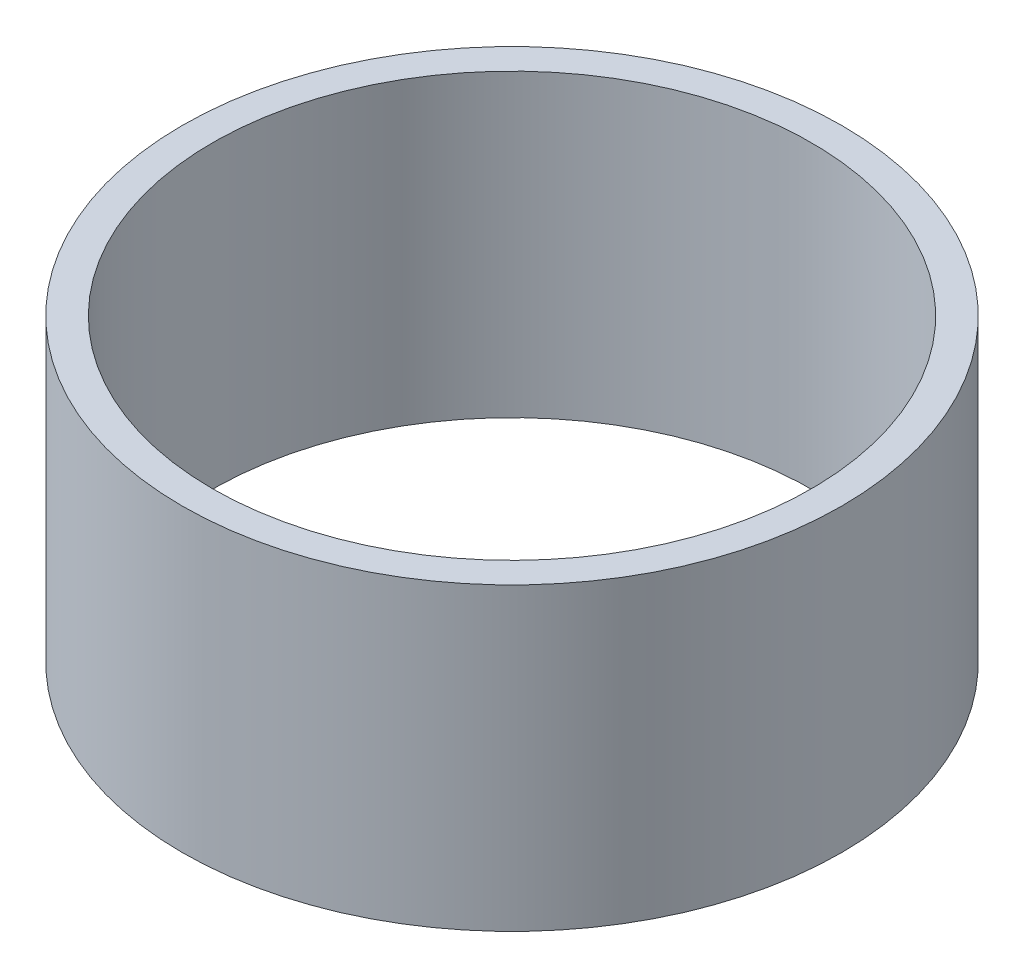
ISO-10303-21;
HEADER;
FILE_DESCRIPTION(('STEP AP214'),'2;1');
FILE_NAME('part.step','',(''),(''),'','','');
FILE_SCHEMA(('AUTOMOTIVE_DESIGN { 1 0 10303 214 1 1 1 1 }'));
ENDSEC;
DATA;
#1=APPLICATION_CONTEXT('core data for automotive mechanical design processes');
#2=APPLICATION_PROTOCOL_DEFINITION('international standard','automotive_design',2000,#1);
#3=PRODUCT_CONTEXT('',#1,'mechanical');
#4=PRODUCT('Part','Part','',(#3));
#5=PRODUCT_RELATED_PRODUCT_CATEGORY('part','',(#4));
#6=PRODUCT_DEFINITION_FORMATION('','',#4);
#7=PRODUCT_DEFINITION_CONTEXT('part definition',#1,'design');
#8=PRODUCT_DEFINITION('design','',#6,#7);
#9=PRODUCT_DEFINITION_SHAPE('','',#8);
#10=(LENGTH_UNIT() NAMED_UNIT(*) SI_UNIT(.MILLI.,.METRE.));
#11=(NAMED_UNIT(*) PLANE_ANGLE_UNIT() SI_UNIT($,.RADIAN.));
#12=(NAMED_UNIT(*) SI_UNIT($,.STERADIAN.) SOLID_ANGLE_UNIT());
#13=UNCERTAINTY_MEASURE_WITH_UNIT(LENGTH_MEASURE(1.E-05),#10,'distance_accuracy_value','');
#14=(GEOMETRIC_REPRESENTATION_CONTEXT(3) GLOBAL_UNCERTAINTY_ASSIGNED_CONTEXT((#13)) GLOBAL_UNIT_ASSIGNED_CONTEXT((#10,
#11,#12)) REPRESENTATION_CONTEXT('',''));
#15=CARTESIAN_POINT('',(0.,0.,0.));
#16=DIRECTION('',(0.,0.,1.));
#17=DIRECTION('',(1.,0.,0.));
#18=AXIS2_PLACEMENT_3D('',#15,#16,#17);
#19=CARTESIAN_POINT('',(0.,52.3354694355045,0.));
#20=DIRECTION('',(0.,-1.,0.));
#21=DIRECTION('',(0.,0.,-1.));
#22=AXIS2_PLACEMENT_3D('',#19,#20,#21);
#23=CYLINDRICAL_SURFACE('',#22,57.5);
#24=CARTESIAN_POINT('',(0.,52.3354694355045,0.));
#25=DIRECTION('',(0.,1.,0.));
#26=DIRECTION('',(0.,0.,1.));
#27=AXIS2_PLACEMENT_3D('',#24,#25,#26);
#28=CIRCLE('',#27,57.5);
#29=CARTESIAN_POINT('',(0.,52.3354694355045,57.5));
#30=VERTEX_POINT('',#29);
#31=EDGE_CURVE('E10',#30,#30,#28,.T.);
#32=ORIENTED_EDGE('',*,*,#31,.F.);
#33=EDGE_LOOP('',(#32));
#34=FACE_BOUND('',#33,.T.);
#35=CARTESIAN_POINT('',(0.,0.,0.));
#36=DIRECTION('',(0.,1.,0.));
#37=DIRECTION('',(0.,0.,1.));
#38=AXIS2_PLACEMENT_3D('',#35,#36,#37);
#39=CIRCLE('',#38,57.5);
#40=CARTESIAN_POINT('',(0.,0.,57.5));
#41=VERTEX_POINT('',#40);
#42=EDGE_CURVE('E37',#41,#41,#39,.T.);
#43=ORIENTED_EDGE('',*,*,#42,.T.);
#44=EDGE_LOOP('',(#43));
#45=FACE_BOUND('',#44,.T.);
#46=ADVANCED_FACE('F40',(#34,#45),#23,.T.);
#47=CARTESIAN_POINT('',(0.,52.3354694355045,0.));
#48=DIRECTION('',(0.,1.,0.));
#49=DIRECTION('',(0.,0.,1.));
#50=AXIS2_PLACEMENT_3D('',#47,#48,#49);
#51=PLANE('',#50);
#52=CARTESIAN_POINT('',(0.,52.3354694355045,0.));
#53=DIRECTION('',(0.,1.,0.));
#54=DIRECTION('',(0.,0.,1.));
#55=AXIS2_PLACEMENT_3D('',#52,#53,#54);
#56=CIRCLE('',#55,52.2476251818569);
#57=CARTESIAN_POINT('',(0.,52.3354694355045,52.2476251818569));
#58=VERTEX_POINT('',#57);
#59=EDGE_CURVE('E50',#58,#58,#56,.T.);
#60=ORIENTED_EDGE('',*,*,#59,.F.);
#61=EDGE_LOOP('',(#60));
#62=FACE_BOUND('',#61,.T.);
#63=ORIENTED_EDGE('',*,*,#31,.T.);
#64=EDGE_LOOP('',(#63));
#65=FACE_BOUND('',#64,.T.);
#66=ADVANCED_FACE('F59',(#62,#65),#51,.T.);
#67=CARTESIAN_POINT('',(0.,0.,0.));
#68=DIRECTION('',(0.,1.,0.));
#69=DIRECTION('',(0.,0.,1.));
#70=AXIS2_PLACEMENT_3D('',#67,#68,#69);
#71=PLANE('',#70);
#72=CARTESIAN_POINT('',(0.,0.,0.));
#73=DIRECTION('',(0.,1.,0.));
#74=DIRECTION('',(0.,0.,1.));
#75=AXIS2_PLACEMENT_3D('',#72,#73,#74);
#76=CIRCLE('',#75,52.2476251818569);
#77=CARTESIAN_POINT('',(0.,0.,52.2476251818569));
#78=VERTEX_POINT('',#77);
#79=EDGE_CURVE('E47',#78,#78,#76,.T.);
#80=ORIENTED_EDGE('',*,*,#79,.T.);
#81=EDGE_LOOP('',(#80));
#82=FACE_BOUND('',#81,.T.);
#83=ORIENTED_EDGE('',*,*,#42,.F.);
#84=EDGE_LOOP('',(#83));
#85=FACE_BOUND('',#84,.T.);
#86=ADVANCED_FACE('F58',(#82,#85),#71,.F.);
#87=CARTESIAN_POINT('',(0.,52.3354694355045,0.));
#88=DIRECTION('',(0.,-1.,0.));
#89=DIRECTION('',(0.,0.,-1.));
#90=AXIS2_PLACEMENT_3D('',#87,#88,#89);
#91=CYLINDRICAL_SURFACE('',#90,52.2476251818569);
#92=ORIENTED_EDGE('',*,*,#59,.T.);
#93=EDGE_LOOP('',(#92));
#94=FACE_BOUND('',#93,.T.);
#95=ORIENTED_EDGE('',*,*,#79,.F.);
#96=EDGE_LOOP('',(#95));
#97=FACE_BOUND('',#96,.T.);
#98=ADVANCED_FACE('F54',(#94,#97),#91,.F.);
#99=CLOSED_SHELL('',(#46,#66,#86,#98));
#100=MANIFOLD_SOLID_BREP('B2',#99);
#101=ADVANCED_BREP_SHAPE_REPRESENTATION('',(#18,#100),#14);
#102=SHAPE_DEFINITION_REPRESENTATION(#9,#101);
ENDSEC;
END-ISO-10303-21;
